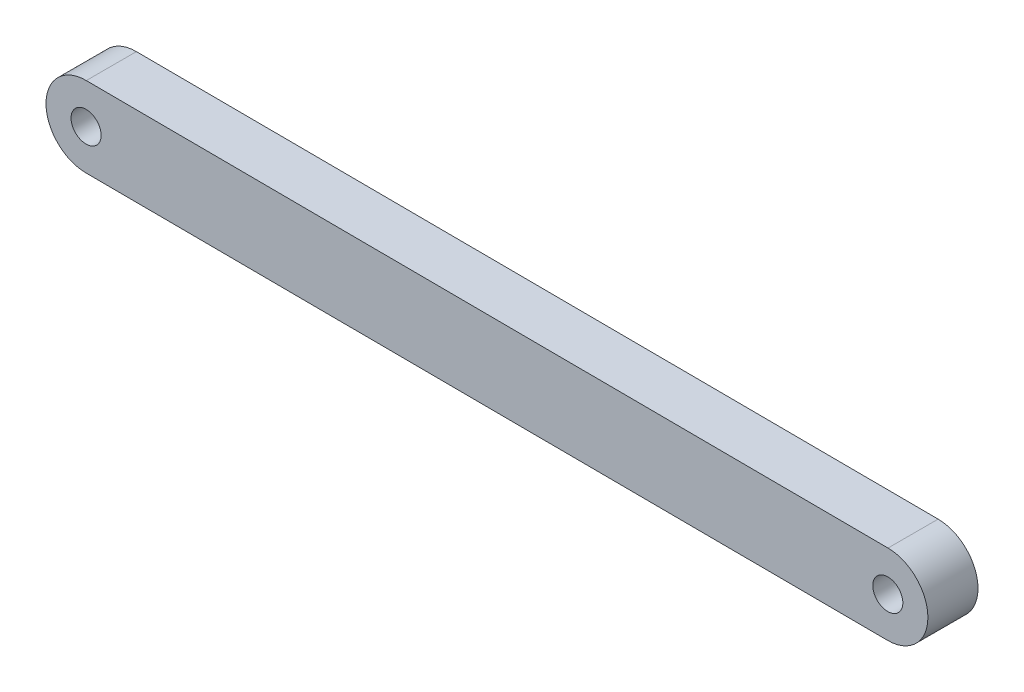
ISO-10303-21;
HEADER;
FILE_DESCRIPTION(('STEP AP214'),'2;1');
FILE_NAME('part.step','',(''),(''),'','','');
FILE_SCHEMA(('AUTOMOTIVE_DESIGN { 1 0 10303 214 1 1 1 1 }'));
ENDSEC;
DATA;
#1=APPLICATION_CONTEXT('core data for automotive mechanical design processes');
#2=APPLICATION_PROTOCOL_DEFINITION('international standard','automotive_design',2000,#1);
#3=PRODUCT_CONTEXT('',#1,'mechanical');
#4=PRODUCT('Part','Part','',(#3));
#5=PRODUCT_RELATED_PRODUCT_CATEGORY('part','',(#4));
#6=PRODUCT_DEFINITION_FORMATION('','',#4);
#7=PRODUCT_DEFINITION_CONTEXT('part definition',#1,'design');
#8=PRODUCT_DEFINITION('design','',#6,#7);
#9=PRODUCT_DEFINITION_SHAPE('','',#8);
#10=(LENGTH_UNIT() NAMED_UNIT(*) SI_UNIT(.MILLI.,.METRE.));
#11=(NAMED_UNIT(*) PLANE_ANGLE_UNIT() SI_UNIT($,.RADIAN.));
#12=(NAMED_UNIT(*) SI_UNIT($,.STERADIAN.) SOLID_ANGLE_UNIT());
#13=UNCERTAINTY_MEASURE_WITH_UNIT(LENGTH_MEASURE(1.E-05),#10,'distance_accuracy_value','');
#14=(GEOMETRIC_REPRESENTATION_CONTEXT(3) GLOBAL_UNCERTAINTY_ASSIGNED_CONTEXT((#13)) GLOBAL_UNIT_ASSIGNED_CONTEXT((#10,
#11,#12)) REPRESENTATION_CONTEXT('',''));
#15=CARTESIAN_POINT('',(0.,0.,0.));
#16=DIRECTION('',(0.,0.,1.));
#17=DIRECTION('',(1.,0.,0.));
#18=AXIS2_PLACEMENT_3D('',#15,#16,#17);
#19=CARTESIAN_POINT('',(0.,0.,5.));
#20=DIRECTION('',(0.,0.,1.));
#21=DIRECTION('',(1.,0.,0.));
#22=AXIS2_PLACEMENT_3D('',#19,#20,#21);
#23=PLANE('',#22);
#24=CARTESIAN_POINT('',(0.,0.,5.));
#25=DIRECTION('',(0.,0.,1.));
#26=DIRECTION('',(1.,0.,0.));
#27=AXIS2_PLACEMENT_3D('',#24,#25,#26);
#28=CIRCLE('',#27,1.5);
#29=CARTESIAN_POINT('',(1.5,0.,5.));
#30=VERTEX_POINT('',#29);
#31=EDGE_CURVE('E103',#30,#30,#28,.T.);
#32=ORIENTED_EDGE('',*,*,#31,.F.);
#33=EDGE_LOOP('',(#32));
#34=FACE_BOUND('',#33,.T.);
#35=CARTESIAN_POINT('',(0.,0.,5.));
#36=DIRECTION('',(0.,0.,1.));
#37=DIRECTION('',(1.,0.,0.));
#38=AXIS2_PLACEMENT_3D('',#35,#36,#37);
#39=CIRCLE('',#38,3.99999999999999);
#40=CARTESIAN_POINT('',(0.0200025295460833,3.9999499870388,5.));
#41=VERTEX_POINT('',#40);
#42=CARTESIAN_POINT('',(-0.0200025295460833,-3.9999499870388,5.));
#43=VERTEX_POINT('',#42);
#44=EDGE_CURVE('E88',#41,#43,#39,.T.);
#45=ORIENTED_EDGE('',*,*,#44,.T.);
#46=DIRECTION('',(0.999987496759702,-0.00500063238652086,0.));
#47=VECTOR('',#46,1.);
#48=CARTESIAN_POINT('',(-0.0200025295460833,-3.9999499870388,5.));
#49=LINE('',#48,#47);
#50=CARTESIAN_POINT('',(79.9799974704539,-4.40000557995168,5.));
#51=VERTEX_POINT('',#50);
#52=EDGE_CURVE('E83',#43,#51,#49,.T.);
#53=ORIENTED_EDGE('',*,*,#52,.T.);
#54=CARTESIAN_POINT('',(80.,-0.400055592912878,5.));
#55=DIRECTION('',(0.,0.,1.));
#56=DIRECTION('',(1.,0.,0.));
#57=AXIS2_PLACEMENT_3D('',#54,#55,#56);
#58=CIRCLE('',#57,3.99999999999999);
#59=CARTESIAN_POINT('',(80.0200025295461,3.59989439412592,5.));
#60=VERTEX_POINT('',#59);
#61=EDGE_CURVE('E86',#51,#60,#58,.T.);
#62=ORIENTED_EDGE('',*,*,#61,.T.);
#63=DIRECTION('',(-0.999987496759702,0.00500063238652084,0.));
#64=VECTOR('',#63,1.);
#65=CARTESIAN_POINT('',(0.0200025295460833,3.9999499870388,5.));
#66=LINE('',#65,#64);
#67=EDGE_CURVE('E53',#60,#41,#66,.T.);
#68=ORIENTED_EDGE('',*,*,#67,.T.);
#69=EDGE_LOOP('',(#45,#53,#62,#68));
#70=FACE_BOUND('',#69,.T.);
#71=CARTESIAN_POINT('',(80.,-0.400055592912878,5.));
#72=DIRECTION('',(0.,0.,1.));
#73=DIRECTION('',(1.,0.,0.));
#74=AXIS2_PLACEMENT_3D('',#71,#72,#73);
#75=CIRCLE('',#74,1.5);
#76=CARTESIAN_POINT('',(81.5,-0.400055592912878,5.));
#77=VERTEX_POINT('',#76);
#78=EDGE_CURVE('E118',#77,#77,#75,.T.);
#79=ORIENTED_EDGE('',*,*,#78,.F.);
#80=EDGE_LOOP('',(#79));
#81=FACE_BOUND('',#80,.T.);
#82=ADVANCED_FACE('F36',(#34,#70,#81),#23,.T.);
#83=CARTESIAN_POINT('',(0.,0.,0.));
#84=DIRECTION('',(0.,0.,1.));
#85=DIRECTION('',(1.,0.,0.));
#86=AXIS2_PLACEMENT_3D('',#83,#84,#85);
#87=PLANE('',#86);
#88=CARTESIAN_POINT('',(0.,0.,0.));
#89=DIRECTION('',(0.,0.,1.));
#90=DIRECTION('',(1.,0.,0.));
#91=AXIS2_PLACEMENT_3D('',#88,#89,#90);
#92=CIRCLE('',#91,3.99999999999999);
#93=CARTESIAN_POINT('',(0.0200025295460833,3.9999499870388,0.));
#94=VERTEX_POINT('',#93);
#95=CARTESIAN_POINT('',(-0.0200025295460833,-3.9999499870388,0.));
#96=VERTEX_POINT('',#95);
#97=EDGE_CURVE('E100',#94,#96,#92,.T.);
#98=ORIENTED_EDGE('',*,*,#97,.F.);
#99=DIRECTION('',(-0.999987496759702,0.00500063238652084,0.));
#100=VECTOR('',#99,1.);
#101=CARTESIAN_POINT('',(0.0200025295460833,3.9999499870388,0.));
#102=LINE('',#101,#100);
#103=CARTESIAN_POINT('',(80.0200025295461,3.59989439412592,0.));
#104=VERTEX_POINT('',#103);
#105=EDGE_CURVE('E76',#104,#94,#102,.T.);
#106=ORIENTED_EDGE('',*,*,#105,.F.);
#107=CARTESIAN_POINT('',(80.,-0.400055592912878,0.));
#108=DIRECTION('',(0.,0.,1.));
#109=DIRECTION('',(1.,0.,0.));
#110=AXIS2_PLACEMENT_3D('',#107,#108,#109);
#111=CIRCLE('',#110,3.99999999999999);
#112=CARTESIAN_POINT('',(79.9799974704539,-4.40000557995168,0.));
#113=VERTEX_POINT('',#112);
#114=EDGE_CURVE('E70',#113,#104,#111,.T.);
#115=ORIENTED_EDGE('',*,*,#114,.F.);
#116=DIRECTION('',(0.999987496759702,-0.00500063238652086,0.));
#117=VECTOR('',#116,1.);
#118=CARTESIAN_POINT('',(-0.0200025295460833,-3.9999499870388,0.));
#119=LINE('',#118,#117);
#120=EDGE_CURVE('E92',#96,#113,#119,.T.);
#121=ORIENTED_EDGE('',*,*,#120,.F.);
#122=EDGE_LOOP('',(#98,#106,#115,#121));
#123=FACE_BOUND('',#122,.T.);
#124=CARTESIAN_POINT('',(0.,0.,0.));
#125=DIRECTION('',(0.,0.,1.));
#126=DIRECTION('',(1.,0.,0.));
#127=AXIS2_PLACEMENT_3D('',#124,#125,#126);
#128=CIRCLE('',#127,1.5);
#129=CARTESIAN_POINT('',(1.5,0.,0.));
#130=VERTEX_POINT('',#129);
#131=EDGE_CURVE('E115',#130,#130,#128,.T.);
#132=ORIENTED_EDGE('',*,*,#131,.T.);
#133=EDGE_LOOP('',(#132));
#134=FACE_BOUND('',#133,.T.);
#135=CARTESIAN_POINT('',(80.,-0.400055592912878,0.));
#136=DIRECTION('',(0.,0.,1.));
#137=DIRECTION('',(1.,0.,0.));
#138=AXIS2_PLACEMENT_3D('',#135,#136,#137);
#139=CIRCLE('',#138,1.5);
#140=CARTESIAN_POINT('',(81.5,-0.400055592912878,0.));
#141=VERTEX_POINT('',#140);
#142=EDGE_CURVE('E121',#141,#141,#139,.T.);
#143=ORIENTED_EDGE('',*,*,#142,.T.);
#144=EDGE_LOOP('',(#143));
#145=FACE_BOUND('',#144,.T.);
#146=ADVANCED_FACE('F111',(#123,#134,#145),#87,.F.);
#147=CARTESIAN_POINT('',(0.,0.,5.));
#148=DIRECTION('',(0.,0.,-1.));
#149=DIRECTION('',(-1.,0.,0.));
#150=AXIS2_PLACEMENT_3D('',#147,#148,#149);
#151=CYLINDRICAL_SURFACE('',#150,3.99999999999999);
#152=ORIENTED_EDGE('',*,*,#97,.T.);
#153=DIRECTION('',(0.,0.,-1.));
#154=VECTOR('',#153,1.);
#155=CARTESIAN_POINT('',(-0.0200025295460833,-3.9999499870388,5.));
#156=LINE('',#155,#154);
#157=EDGE_CURVE('E11',#43,#96,#156,.T.);
#158=ORIENTED_EDGE('',*,*,#157,.F.);
#159=ORIENTED_EDGE('',*,*,#44,.F.);
#160=DIRECTION('',(0.,0.,-1.));
#161=VECTOR('',#160,1.);
#162=CARTESIAN_POINT('',(0.0200025295460833,3.9999499870388,5.));
#163=LINE('',#162,#161);
#164=EDGE_CURVE('E96',#41,#94,#163,.T.);
#165=ORIENTED_EDGE('',*,*,#164,.T.);
#166=EDGE_LOOP('',(#152,#158,#159,#165));
#167=FACE_BOUND('',#166,.T.);
#168=ADVANCED_FACE('F38',(#167),#151,.T.);
#169=CARTESIAN_POINT('',(-0.0200025295460833,-3.9999499870388,5.));
#170=DIRECTION('',(0.00500063238652086,0.999987496759702,0.));
#171=DIRECTION('',(-0.999987496759702,0.00500063238652086,0.));
#172=AXIS2_PLACEMENT_3D('',#169,#170,#171);
#173=PLANE('',#172);
#174=ORIENTED_EDGE('',*,*,#120,.T.);
#175=DIRECTION('',(0.,0.,-1.));
#176=VECTOR('',#175,1.);
#177=CARTESIAN_POINT('',(79.9799974704539,-4.40000557995168,5.));
#178=LINE('',#177,#176);
#179=EDGE_CURVE('E45',#51,#113,#178,.T.);
#180=ORIENTED_EDGE('',*,*,#179,.F.);
#181=ORIENTED_EDGE('',*,*,#52,.F.);
#182=ORIENTED_EDGE('',*,*,#157,.T.);
#183=EDGE_LOOP('',(#174,#180,#181,#182));
#184=FACE_BOUND('',#183,.T.);
#185=ADVANCED_FACE('F91',(#184),#173,.F.);
#186=CARTESIAN_POINT('',(80.,-0.400055592912878,5.));
#187=DIRECTION('',(0.,0.,-1.));
#188=DIRECTION('',(-1.,0.,0.));
#189=AXIS2_PLACEMENT_3D('',#186,#187,#188);
#190=CYLINDRICAL_SURFACE('',#189,3.99999999999999);
#191=ORIENTED_EDGE('',*,*,#114,.T.);
#192=DIRECTION('',(0.,0.,-1.));
#193=VECTOR('',#192,1.);
#194=CARTESIAN_POINT('',(80.0200025295461,3.59989439412592,5.));
#195=LINE('',#194,#193);
#196=EDGE_CURVE('E93',#60,#104,#195,.T.);
#197=ORIENTED_EDGE('',*,*,#196,.F.);
#198=ORIENTED_EDGE('',*,*,#61,.F.);
#199=ORIENTED_EDGE('',*,*,#179,.T.);
#200=EDGE_LOOP('',(#191,#197,#198,#199));
#201=FACE_BOUND('',#200,.T.);
#202=ADVANCED_FACE('F94',(#201),#190,.T.);
#203=CARTESIAN_POINT('',(0.0200025295460833,3.9999499870388,5.));
#204=DIRECTION('',(-0.00500063238652084,-0.999987496759702,0.));
#205=DIRECTION('',(0.999987496759702,-0.00500063238652084,0.));
#206=AXIS2_PLACEMENT_3D('',#203,#204,#205);
#207=PLANE('',#206);
#208=ORIENTED_EDGE('',*,*,#105,.T.);
#209=ORIENTED_EDGE('',*,*,#164,.F.);
#210=ORIENTED_EDGE('',*,*,#67,.F.);
#211=ORIENTED_EDGE('',*,*,#196,.T.);
#212=EDGE_LOOP('',(#208,#209,#210,#211));
#213=FACE_BOUND('',#212,.T.);
#214=ADVANCED_FACE('F108',(#213),#207,.F.);
#215=CARTESIAN_POINT('',(0.,0.,5.));
#216=DIRECTION('',(0.,0.,-1.));
#217=DIRECTION('',(-1.,0.,0.));
#218=AXIS2_PLACEMENT_3D('',#215,#216,#217);
#219=CYLINDRICAL_SURFACE('',#218,1.5);
#220=ORIENTED_EDGE('',*,*,#31,.T.);
#221=EDGE_LOOP('',(#220));
#222=FACE_BOUND('',#221,.T.);
#223=ORIENTED_EDGE('',*,*,#131,.F.);
#224=EDGE_LOOP('',(#223));
#225=FACE_BOUND('',#224,.T.);
#226=ADVANCED_FACE('F138',(#222,#225),#219,.F.);
#227=CARTESIAN_POINT('',(80.,-0.400055592912878,5.));
#228=DIRECTION('',(0.,0.,-1.));
#229=DIRECTION('',(-1.,0.,0.));
#230=AXIS2_PLACEMENT_3D('',#227,#228,#229);
#231=CYLINDRICAL_SURFACE('',#230,1.5);
#232=ORIENTED_EDGE('',*,*,#78,.T.);
#233=EDGE_LOOP('',(#232));
#234=FACE_BOUND('',#233,.T.);
#235=ORIENTED_EDGE('',*,*,#142,.F.);
#236=EDGE_LOOP('',(#235));
#237=FACE_BOUND('',#236,.T.);
#238=ADVANCED_FACE('F127',(#234,#237),#231,.F.);
#239=CLOSED_SHELL('',(#82,#146,#168,#185,#202,#214,#226,#238));
#240=MANIFOLD_SOLID_BREP('B2',#239);
#241=ADVANCED_BREP_SHAPE_REPRESENTATION('',(#18,#240),#14);
#242=SHAPE_DEFINITION_REPRESENTATION(#9,#241);
ENDSEC;
END-ISO-10303-21;
